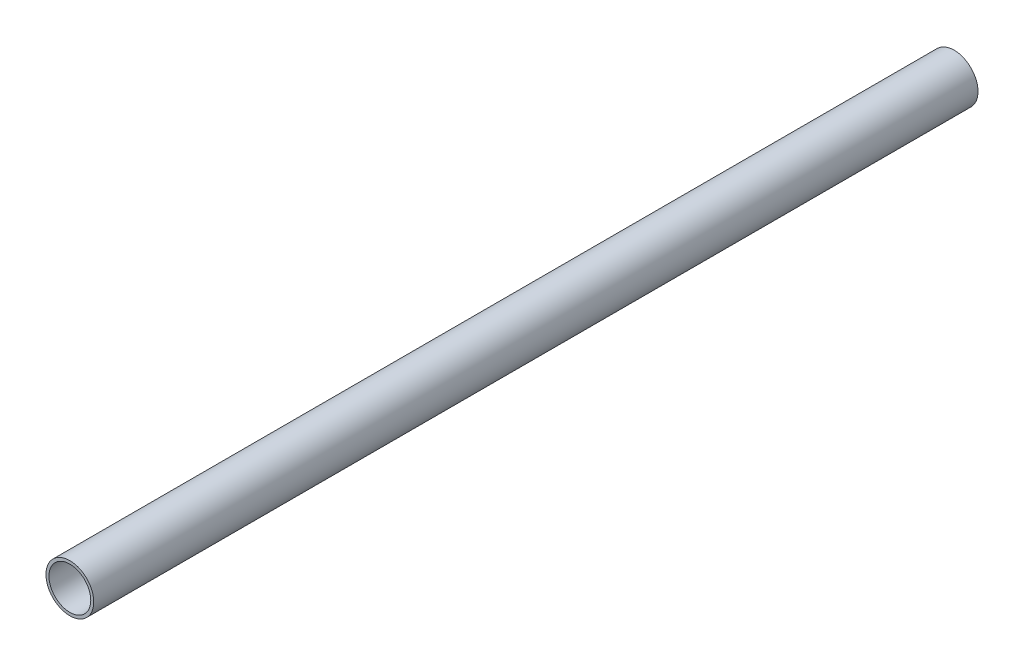
ISO-10303-21;
HEADER;
FILE_DESCRIPTION(('STEP AP214'),'2;1');
FILE_NAME('part.step','',(''),(''),'','','');
FILE_SCHEMA(('AUTOMOTIVE_DESIGN { 1 0 10303 214 1 1 1 1 }'));
ENDSEC;
DATA;
#1=APPLICATION_CONTEXT('core data for automotive mechanical design processes');
#2=APPLICATION_PROTOCOL_DEFINITION('international standard','automotive_design',2000,#1);
#3=PRODUCT_CONTEXT('',#1,'mechanical');
#4=PRODUCT('Part','Part','',(#3));
#5=PRODUCT_RELATED_PRODUCT_CATEGORY('part','',(#4));
#6=PRODUCT_DEFINITION_FORMATION('','',#4);
#7=PRODUCT_DEFINITION_CONTEXT('part definition',#1,'design');
#8=PRODUCT_DEFINITION('design','',#6,#7);
#9=PRODUCT_DEFINITION_SHAPE('','',#8);
#10=(LENGTH_UNIT() NAMED_UNIT(*) SI_UNIT(.MILLI.,.METRE.));
#11=(NAMED_UNIT(*) PLANE_ANGLE_UNIT() SI_UNIT($,.RADIAN.));
#12=(NAMED_UNIT(*) SI_UNIT($,.STERADIAN.) SOLID_ANGLE_UNIT());
#13=UNCERTAINTY_MEASURE_WITH_UNIT(LENGTH_MEASURE(1.E-05),#10,'distance_accuracy_value','');
#14=(GEOMETRIC_REPRESENTATION_CONTEXT(3) GLOBAL_UNCERTAINTY_ASSIGNED_CONTEXT((#13)) GLOBAL_UNIT_ASSIGNED_CONTEXT((#10,
#11,#12)) REPRESENTATION_CONTEXT('',''));
#15=CARTESIAN_POINT('',(0.,0.,0.));
#16=DIRECTION('',(0.,0.,1.));
#17=DIRECTION('',(1.,0.,0.));
#18=AXIS2_PLACEMENT_3D('',#15,#16,#17);
#19=CARTESIAN_POINT('',(0.,0.,469.9));
#20=DIRECTION('',(0.,0.,1.));
#21=DIRECTION('',(1.,0.,0.));
#22=AXIS2_PLACEMENT_3D('',#19,#20,#21);
#23=PLANE('',#22);
#24=CARTESIAN_POINT('',(0.,0.,469.9));
#25=DIRECTION('',(0.,0.,1.));
#26=DIRECTION('',(1.,0.,0.));
#27=AXIS2_PLACEMENT_3D('',#24,#25,#26);
#28=CIRCLE('',#27,12.7);
#29=CARTESIAN_POINT('',(12.7,0.,469.9));
#30=VERTEX_POINT('',#29);
#31=EDGE_CURVE('E10',#30,#30,#28,.T.);
#32=ORIENTED_EDGE('',*,*,#31,.T.);
#33=EDGE_LOOP('',(#32));
#34=FACE_BOUND('',#33,.T.);
#35=CARTESIAN_POINT('',(0.,0.,469.9));
#36=DIRECTION('',(0.,0.,1.));
#37=DIRECTION('',(1.,0.,0.));
#38=AXIS2_PLACEMENT_3D('',#35,#36,#37);
#39=CIRCLE('',#38,11.1125);
#40=CARTESIAN_POINT('',(11.1125,0.,469.9));
#41=VERTEX_POINT('',#40);
#42=EDGE_CURVE('E44',#41,#41,#39,.T.);
#43=ORIENTED_EDGE('',*,*,#42,.F.);
#44=EDGE_LOOP('',(#43));
#45=FACE_BOUND('',#44,.T.);
#46=ADVANCED_FACE('F33',(#34,#45),#23,.T.);
#47=CARTESIAN_POINT('',(0.,0.,0.));
#48=DIRECTION('',(0.,0.,1.));
#49=DIRECTION('',(1.,0.,0.));
#50=AXIS2_PLACEMENT_3D('',#47,#48,#49);
#51=PLANE('',#50);
#52=CARTESIAN_POINT('',(0.,0.,0.));
#53=DIRECTION('',(0.,0.,1.));
#54=DIRECTION('',(1.,0.,0.));
#55=AXIS2_PLACEMENT_3D('',#52,#53,#54);
#56=CIRCLE('',#55,12.7);
#57=CARTESIAN_POINT('',(12.7,0.,0.));
#58=VERTEX_POINT('',#57);
#59=EDGE_CURVE('E37',#58,#58,#56,.T.);
#60=ORIENTED_EDGE('',*,*,#59,.F.);
#61=EDGE_LOOP('',(#60));
#62=FACE_BOUND('',#61,.T.);
#63=CARTESIAN_POINT('',(0.,0.,0.));
#64=DIRECTION('',(0.,0.,1.));
#65=DIRECTION('',(1.,0.,0.));
#66=AXIS2_PLACEMENT_3D('',#63,#64,#65);
#67=CIRCLE('',#66,11.1125);
#68=CARTESIAN_POINT('',(11.1125,0.,0.));
#69=VERTEX_POINT('',#68);
#70=EDGE_CURVE('E46',#69,#69,#67,.T.);
#71=ORIENTED_EDGE('',*,*,#70,.T.);
#72=EDGE_LOOP('',(#71));
#73=FACE_BOUND('',#72,.T.);
#74=ADVANCED_FACE('F56',(#62,#73),#51,.F.);
#75=CARTESIAN_POINT('',(0.,0.,469.9));
#76=DIRECTION('',(0.,0.,-1.));
#77=DIRECTION('',(-1.,0.,0.));
#78=AXIS2_PLACEMENT_3D('',#75,#76,#77);
#79=CYLINDRICAL_SURFACE('',#78,12.7);
#80=ORIENTED_EDGE('',*,*,#31,.F.);
#81=EDGE_LOOP('',(#80));
#82=FACE_BOUND('',#81,.T.);
#83=ORIENTED_EDGE('',*,*,#59,.T.);
#84=EDGE_LOOP('',(#83));
#85=FACE_BOUND('',#84,.T.);
#86=ADVANCED_FACE('F35',(#82,#85),#79,.T.);
#87=CARTESIAN_POINT('',(0.,0.,469.9));
#88=DIRECTION('',(0.,0.,-1.));
#89=DIRECTION('',(-1.,0.,0.));
#90=AXIS2_PLACEMENT_3D('',#87,#88,#89);
#91=CYLINDRICAL_SURFACE('',#90,11.1125);
#92=ORIENTED_EDGE('',*,*,#42,.T.);
#93=EDGE_LOOP('',(#92));
#94=FACE_BOUND('',#93,.T.);
#95=ORIENTED_EDGE('',*,*,#70,.F.);
#96=EDGE_LOOP('',(#95));
#97=FACE_BOUND('',#96,.T.);
#98=ADVANCED_FACE('F52',(#94,#97),#91,.F.);
#99=CLOSED_SHELL('',(#46,#74,#86,#98));
#100=MANIFOLD_SOLID_BREP('B2',#99);
#101=ADVANCED_BREP_SHAPE_REPRESENTATION('',(#18,#100),#14);
#102=SHAPE_DEFINITION_REPRESENTATION(#9,#101);
ENDSEC;
END-ISO-10303-21;
